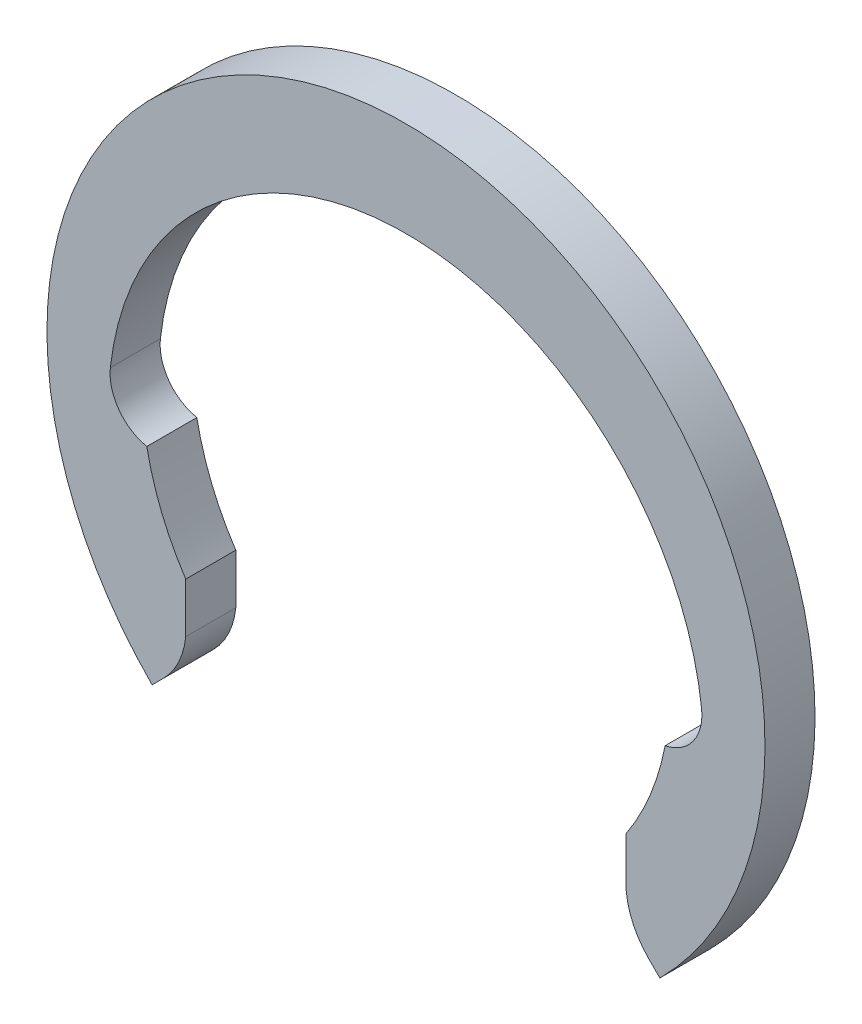
ISO-10303-21;
HEADER;
FILE_DESCRIPTION(('STEP AP214'),'2;1');
FILE_NAME('part.step','',(''),(''),'','','');
FILE_SCHEMA(('AUTOMOTIVE_DESIGN { 1 0 10303 214 1 1 1 1 }'));
ENDSEC;
DATA;
#1=APPLICATION_CONTEXT('core data for automotive mechanical design processes');
#2=APPLICATION_PROTOCOL_DEFINITION('international standard','automotive_design',2000,#1);
#3=PRODUCT_CONTEXT('',#1,'mechanical');
#4=PRODUCT('Part','Part','',(#3));
#5=PRODUCT_RELATED_PRODUCT_CATEGORY('part','',(#4));
#6=PRODUCT_DEFINITION_FORMATION('','',#4);
#7=PRODUCT_DEFINITION_CONTEXT('part definition',#1,'design');
#8=PRODUCT_DEFINITION('design','',#6,#7);
#9=PRODUCT_DEFINITION_SHAPE('','',#8);
#10=(LENGTH_UNIT() NAMED_UNIT(*) SI_UNIT(.MILLI.,.METRE.));
#11=(NAMED_UNIT(*) PLANE_ANGLE_UNIT() SI_UNIT($,.RADIAN.));
#12=(NAMED_UNIT(*) SI_UNIT($,.STERADIAN.) SOLID_ANGLE_UNIT());
#13=UNCERTAINTY_MEASURE_WITH_UNIT(LENGTH_MEASURE(1.E-05),#10,'distance_accuracy_value','');
#14=(GEOMETRIC_REPRESENTATION_CONTEXT(3) GLOBAL_UNCERTAINTY_ASSIGNED_CONTEXT((#13)) GLOBAL_UNIT_ASSIGNED_CONTEXT((#10,
#11,#12)) REPRESENTATION_CONTEXT('',''));
#15=CARTESIAN_POINT('',(0.,0.,0.));
#16=DIRECTION('',(0.,0.,1.));
#17=DIRECTION('',(1.,0.,0.));
#18=AXIS2_PLACEMENT_3D('',#15,#16,#17);
#19=CARTESIAN_POINT('',(-4.9996018580212,-0.103257531389518,1.));
#20=DIRECTION('',(0.,0.,-1.));
#21=DIRECTION('',(-1.,0.,0.));
#22=AXIS2_PLACEMENT_3D('',#19,#20,#21);
#23=CYLINDRICAL_SURFACE('',#22,0.914579144749987);
#24=CARTESIAN_POINT('',(-4.9996018580212,-0.103257531389518,0.));
#25=DIRECTION('',(0.,0.,-1.));
#26=DIRECTION('',(1.,0.,0.));
#27=AXIS2_PLACEMENT_3D('',#24,#25,#26);
#28=CIRCLE('',#27,0.914579144749987);
#29=CARTESIAN_POINT('',(-5.17934600118587,-0.999999999999997,0.));
#30=VERTEX_POINT('',#29);
#31=CARTESIAN_POINT('',(-5.90833333333334,0.,0.));
#32=VERTEX_POINT('',#31);
#33=EDGE_CURVE('E154',#30,#32,#28,.T.);
#34=ORIENTED_EDGE('',*,*,#33,.T.);
#35=DIRECTION('',(0.,0.,-1.));
#36=VECTOR('',#35,1.);
#37=CARTESIAN_POINT('',(-5.90833333333334,0.,1.));
#38=LINE('',#37,#36);
#39=CARTESIAN_POINT('',(-5.90833333333334,0.,1.));
#40=VERTEX_POINT('',#39);
#41=EDGE_CURVE('E11',#40,#32,#38,.T.);
#42=ORIENTED_EDGE('',*,*,#41,.F.);
#43=CARTESIAN_POINT('',(-4.9996018580212,-0.103257531389518,1.));
#44=DIRECTION('',(0.,0.,-1.));
#45=DIRECTION('',(1.,0.,0.));
#46=AXIS2_PLACEMENT_3D('',#43,#44,#45);
#47=CIRCLE('',#46,0.914579144749987);
#48=CARTESIAN_POINT('',(-5.17934600118587,-0.999999999999997,1.));
#49=VERTEX_POINT('',#48);
#50=EDGE_CURVE('E177',#49,#40,#47,.T.);
#51=ORIENTED_EDGE('',*,*,#50,.F.);
#52=DIRECTION('',(0.,0.,-1.));
#53=VECTOR('',#52,1.);
#54=CARTESIAN_POINT('',(-5.17934600118587,-0.999999999999997,1.));
#55=LINE('',#54,#53);
#56=EDGE_CURVE('E150',#49,#30,#55,.T.);
#57=ORIENTED_EDGE('',*,*,#56,.T.);
#58=EDGE_LOOP('',(#34,#42,#51,#57));
#59=FACE_BOUND('',#58,.T.);
#60=ADVANCED_FACE('F34',(#59),#23,.F.);
#61=CARTESIAN_POINT('',(0.,-0.671353343865192,1.));
#62=DIRECTION('',(0.,0.,-1.));
#63=DIRECTION('',(-1.,0.,0.));
#64=AXIS2_PLACEMENT_3D('',#61,#62,#63);
#65=CYLINDRICAL_SURFACE('',#64,5.94635334386519);
#66=CARTESIAN_POINT('',(0.,-0.671353343865192,0.));
#67=DIRECTION('',(0.,0.,-1.));
#68=DIRECTION('',(1.,0.,0.));
#69=AXIS2_PLACEMENT_3D('',#66,#67,#68);
#70=CIRCLE('',#69,5.94635334386519);
#71=CARTESIAN_POINT('',(5.90833333333333,0.,0.));
#72=VERTEX_POINT('',#71);
#73=EDGE_CURVE('E157',#32,#72,#70,.T.);
#74=ORIENTED_EDGE('',*,*,#73,.T.);
#75=DIRECTION('',(0.,0.,-1.));
#76=VECTOR('',#75,1.);
#77=CARTESIAN_POINT('',(5.90833333333333,0.,1.));
#78=LINE('',#77,#76);
#79=CARTESIAN_POINT('',(5.90833333333333,0.,1.));
#80=VERTEX_POINT('',#79);
#81=EDGE_CURVE('E42',#80,#72,#78,.T.);
#82=ORIENTED_EDGE('',*,*,#81,.F.);
#83=CARTESIAN_POINT('',(0.,-0.671353343865192,1.));
#84=DIRECTION('',(0.,0.,-1.));
#85=DIRECTION('',(1.,0.,0.));
#86=AXIS2_PLACEMENT_3D('',#83,#84,#85);
#87=CIRCLE('',#86,5.94635334386519);
#88=EDGE_CURVE('E104',#40,#80,#87,.T.);
#89=ORIENTED_EDGE('',*,*,#88,.F.);
#90=ORIENTED_EDGE('',*,*,#41,.T.);
#91=EDGE_LOOP('',(#74,#82,#89,#90));
#92=FACE_BOUND('',#91,.T.);
#93=ADVANCED_FACE('F254',(#92),#65,.F.);
#94=CARTESIAN_POINT('',(4.99960185802121,-0.103257531389516,1.));
#95=DIRECTION('',(0.,0.,-1.));
#96=DIRECTION('',(-1.,0.,0.));
#97=AXIS2_PLACEMENT_3D('',#94,#95,#96);
#98=CYLINDRICAL_SURFACE('',#97,0.914579144749987);
#99=CARTESIAN_POINT('',(4.99960185802121,-0.103257531389516,0.));
#100=DIRECTION('',(0.,0.,-1.));
#101=DIRECTION('',(-1.,0.,0.));
#102=AXIS2_PLACEMENT_3D('',#99,#100,#101);
#103=CIRCLE('',#102,0.914579144749987);
#104=CARTESIAN_POINT('',(5.17934600118587,-0.999999999999998,0.));
#105=VERTEX_POINT('',#104);
#106=EDGE_CURVE('E159',#72,#105,#103,.T.);
#107=ORIENTED_EDGE('',*,*,#106,.T.);
#108=DIRECTION('',(0.,0.,-1.));
#109=VECTOR('',#108,1.);
#110=CARTESIAN_POINT('',(5.17934600118587,-0.999999999999998,1.));
#111=LINE('',#110,#109);
#112=CARTESIAN_POINT('',(5.17934600118587,-0.999999999999998,1.));
#113=VERTEX_POINT('',#112);
#114=EDGE_CURVE('E196',#113,#105,#111,.T.);
#115=ORIENTED_EDGE('',*,*,#114,.F.);
#116=CARTESIAN_POINT('',(4.99960185802121,-0.103257531389516,1.));
#117=DIRECTION('',(0.,0.,-1.));
#118=DIRECTION('',(-1.,0.,0.));
#119=AXIS2_PLACEMENT_3D('',#116,#117,#118);
#120=CIRCLE('',#119,0.914579144749987);
#121=EDGE_CURVE('E204',#80,#113,#120,.T.);
#122=ORIENTED_EDGE('',*,*,#121,.F.);
#123=ORIENTED_EDGE('',*,*,#81,.T.);
#124=EDGE_LOOP('',(#107,#115,#122,#123));
#125=FACE_BOUND('',#124,.T.);
#126=ADVANCED_FACE('F202',(#125),#98,.F.);
#127=CARTESIAN_POINT('',(0.,0.,1.));
#128=DIRECTION('',(0.,0.,-1.));
#129=DIRECTION('',(-1.,0.,0.));
#130=AXIS2_PLACEMENT_3D('',#127,#128,#129);
#131=CYLINDRICAL_SURFACE('',#130,5.275);
#132=CARTESIAN_POINT('',(0.,0.,0.));
#133=DIRECTION('',(0.,0.,-1.));
#134=DIRECTION('',(-1.,0.,0.));
#135=AXIS2_PLACEMENT_3D('',#132,#133,#134);
#136=CIRCLE('',#135,5.275);
#137=CARTESIAN_POINT('',(4.40173971288627,-2.90694212188684,0.));
#138=VERTEX_POINT('',#137);
#139=EDGE_CURVE('E161',#105,#138,#136,.T.);
#140=ORIENTED_EDGE('',*,*,#139,.T.);
#141=DIRECTION('',(0.,0.,-1.));
#142=VECTOR('',#141,1.);
#143=CARTESIAN_POINT('',(4.40173971288627,-2.90694212188684,1.));
#144=LINE('',#143,#142);
#145=CARTESIAN_POINT('',(4.40173971288627,-2.90694212188684,1.));
#146=VERTEX_POINT('',#145);
#147=EDGE_CURVE('E193',#146,#138,#144,.T.);
#148=ORIENTED_EDGE('',*,*,#147,.F.);
#149=CARTESIAN_POINT('',(0.,0.,1.));
#150=DIRECTION('',(0.,0.,-1.));
#151=DIRECTION('',(-1.,0.,0.));
#152=AXIS2_PLACEMENT_3D('',#149,#150,#151);
#153=CIRCLE('',#152,5.275);
#154=EDGE_CURVE('E221',#113,#146,#153,.T.);
#155=ORIENTED_EDGE('',*,*,#154,.F.);
#156=ORIENTED_EDGE('',*,*,#114,.T.);
#157=EDGE_LOOP('',(#140,#148,#155,#156));
#158=FACE_BOUND('',#157,.T.);
#159=ADVANCED_FACE('F212',(#158),#131,.F.);
#160=CARTESIAN_POINT('',(4.40173971288627,-3.90347384921978,1.));
#161=DIRECTION('',(1.,0.,0.));
#162=DIRECTION('',(0.,1.,0.));
#163=AXIS2_PLACEMENT_3D('',#160,#161,#162);
#164=PLANE('',#163);
#165=DIRECTION('',(0.,-1.,0.));
#166=VECTOR('',#165,1.);
#167=CARTESIAN_POINT('',(4.40173971288627,-3.90347384921978,0.));
#168=LINE('',#167,#166);
#169=CARTESIAN_POINT('',(4.40173971288627,-3.90347384921978,0.));
#170=VERTEX_POINT('',#169);
#171=EDGE_CURVE('E164',#138,#170,#168,.T.);
#172=ORIENTED_EDGE('',*,*,#171,.T.);
#173=DIRECTION('',(0.,0.,-1.));
#174=VECTOR('',#173,1.);
#175=CARTESIAN_POINT('',(4.40173971288627,-3.90347384921978,1.));
#176=LINE('',#175,#174);
#177=CARTESIAN_POINT('',(4.40173971288627,-3.90347384921978,1.));
#178=VERTEX_POINT('',#177);
#179=EDGE_CURVE('E190',#178,#170,#176,.T.);
#180=ORIENTED_EDGE('',*,*,#179,.F.);
#181=DIRECTION('',(0.,-1.,0.));
#182=VECTOR('',#181,1.);
#183=CARTESIAN_POINT('',(4.40173971288627,-3.40520798555331,1.));
#184=LINE('',#183,#182);
#185=EDGE_CURVE('E218',#146,#178,#184,.T.);
#186=ORIENTED_EDGE('',*,*,#185,.F.);
#187=ORIENTED_EDGE('',*,*,#147,.T.);
#188=EDGE_LOOP('',(#172,#180,#186,#187));
#189=FACE_BOUND('',#188,.T.);
#190=ADVANCED_FACE('F216',(#189),#164,.F.);
#191=CARTESIAN_POINT('',(5.9490483497607,-3.75009966551478,1.));
#192=DIRECTION('',(0.,0.,-1.));
#193=DIRECTION('',(-1.,0.,0.));
#194=AXIS2_PLACEMENT_3D('',#191,#192,#193);
#195=CYLINDRICAL_SURFACE('',#194,1.55489152611151);
#196=CARTESIAN_POINT('',(5.9490483497607,-3.75009966551478,0.));
#197=DIRECTION('',(0.,0.,1.));
#198=DIRECTION('',(1.,0.,0.));
#199=AXIS2_PLACEMENT_3D('',#196,#197,#198);
#200=CIRCLE('',#199,1.55489152611151);
#201=CARTESIAN_POINT('',(4.84957400763775,-4.84957400763773,0.));
#202=VERTEX_POINT('',#201);
#203=EDGE_CURVE('E166',#170,#202,#200,.T.);
#204=ORIENTED_EDGE('',*,*,#203,.T.);
#205=DIRECTION('',(0.,0.,-1.));
#206=VECTOR('',#205,1.);
#207=CARTESIAN_POINT('',(4.84957400763775,-4.84957400763773,1.));
#208=LINE('',#207,#206);
#209=CARTESIAN_POINT('',(4.84957400763775,-4.84957400763773,1.));
#210=VERTEX_POINT('',#209);
#211=EDGE_CURVE('E187',#210,#202,#208,.T.);
#212=ORIENTED_EDGE('',*,*,#211,.F.);
#213=CARTESIAN_POINT('',(5.9490483497607,-3.75009966551478,1.));
#214=DIRECTION('',(0.,0.,1.));
#215=DIRECTION('',(1.,0.,0.));
#216=AXIS2_PLACEMENT_3D('',#213,#214,#215);
#217=CIRCLE('',#216,1.55489152611151);
#218=EDGE_CURVE('E220',#178,#210,#217,.T.);
#219=ORIENTED_EDGE('',*,*,#218,.F.);
#220=ORIENTED_EDGE('',*,*,#179,.T.);
#221=EDGE_LOOP('',(#204,#212,#219,#220));
#222=FACE_BOUND('',#221,.T.);
#223=ADVANCED_FACE('F267',(#222),#195,.T.);
#224=CARTESIAN_POINT('',(4.84957400763775,-4.84957400763773,1.));
#225=DIRECTION('',(0.707106781186547,0.707106781186547,0.));
#226=DIRECTION('',(-0.707106781186548,0.707106781186548,0.));
#227=AXIS2_PLACEMENT_3D('',#224,#225,#226);
#228=PLANE('',#227);
#229=DIRECTION('',(0.707106781186547,-0.707106781186547,0.));
#230=VECTOR('',#229,1.);
#231=CARTESIAN_POINT('',(4.84957400763775,-4.84957400763773,0.));
#232=LINE('',#231,#230);
#233=CARTESIAN_POINT('',(5.07349115501349,-5.07349115501347,0.));
#234=VERTEX_POINT('',#233);
#235=EDGE_CURVE('E168',#202,#234,#232,.T.);
#236=ORIENTED_EDGE('',*,*,#235,.T.);
#237=DIRECTION('',(0.,0.,-1.));
#238=VECTOR('',#237,1.);
#239=CARTESIAN_POINT('',(5.07349115501349,-5.07349115501347,1.));
#240=LINE('',#239,#238);
#241=CARTESIAN_POINT('',(5.07349115501349,-5.07349115501347,1.));
#242=VERTEX_POINT('',#241);
#243=EDGE_CURVE('E184',#242,#234,#240,.T.);
#244=ORIENTED_EDGE('',*,*,#243,.F.);
#245=DIRECTION('',(0.707106781186547,-0.707106781186547,0.));
#246=VECTOR('',#245,1.);
#247=CARTESIAN_POINT('',(4.84957400763775,-4.84957400763773,1.));
#248=LINE('',#247,#246);
#249=EDGE_CURVE('E223',#210,#242,#248,.T.);
#250=ORIENTED_EDGE('',*,*,#249,.F.);
#251=ORIENTED_EDGE('',*,*,#211,.T.);
#252=EDGE_LOOP('',(#236,#244,#250,#251));
#253=FACE_BOUND('',#252,.T.);
#254=ADVANCED_FACE('F270',(#253),#228,.F.);
#255=CARTESIAN_POINT('',(0.,0.,1.));
#256=DIRECTION('',(0.,0.,-1.));
#257=DIRECTION('',(-1.,0.,0.));
#258=AXIS2_PLACEMENT_3D('',#255,#256,#257);
#259=CYLINDRICAL_SURFACE('',#258,7.175);
#260=CARTESIAN_POINT('',(0.,0.,0.));
#261=DIRECTION('',(0.,0.,1.));
#262=DIRECTION('',(1.,0.,0.));
#263=AXIS2_PLACEMENT_3D('',#260,#261,#262);
#264=CIRCLE('',#263,7.175);
#265=CARTESIAN_POINT('',(-5.07349115501349,-5.07349115501347,0.));
#266=VERTEX_POINT('',#265);
#267=EDGE_CURVE('E170',#234,#266,#264,.T.);
#268=ORIENTED_EDGE('',*,*,#267,.T.);
#269=DIRECTION('',(0.,0.,-1.));
#270=VECTOR('',#269,1.);
#271=CARTESIAN_POINT('',(-5.07349115501349,-5.07349115501347,1.));
#272=LINE('',#271,#270);
#273=CARTESIAN_POINT('',(-5.07349115501349,-5.07349115501347,1.));
#274=VERTEX_POINT('',#273);
#275=EDGE_CURVE('E181',#274,#266,#272,.T.);
#276=ORIENTED_EDGE('',*,*,#275,.F.);
#277=CARTESIAN_POINT('',(0.,0.,1.));
#278=DIRECTION('',(0.,0.,1.));
#279=DIRECTION('',(1.,0.,0.));
#280=AXIS2_PLACEMENT_3D('',#277,#278,#279);
#281=CIRCLE('',#280,7.175);
#282=EDGE_CURVE('E229',#242,#274,#281,.T.);
#283=ORIENTED_EDGE('',*,*,#282,.F.);
#284=ORIENTED_EDGE('',*,*,#243,.T.);
#285=EDGE_LOOP('',(#268,#276,#283,#284));
#286=FACE_BOUND('',#285,.T.);
#287=ADVANCED_FACE('F235',(#286),#259,.T.);
#288=CARTESIAN_POINT('',(-4.84957400763775,-4.84957400763773,1.));
#289=DIRECTION('',(-0.707106781186547,0.707106781186547,0.));
#290=DIRECTION('',(-0.707106781186548,-0.707106781186548,0.));
#291=AXIS2_PLACEMENT_3D('',#288,#289,#290);
#292=PLANE('',#291);
#293=DIRECTION('',(0.707106781186547,0.707106781186547,0.));
#294=VECTOR('',#293,1.);
#295=CARTESIAN_POINT('',(-4.84957400763775,-4.84957400763773,0.));
#296=LINE('',#295,#294);
#297=CARTESIAN_POINT('',(-4.84957400763775,-4.84957400763773,0.));
#298=VERTEX_POINT('',#297);
#299=EDGE_CURVE('E172',#266,#298,#296,.T.);
#300=ORIENTED_EDGE('',*,*,#299,.T.);
#301=DIRECTION('',(0.,0.,-1.));
#302=VECTOR('',#301,1.);
#303=CARTESIAN_POINT('',(-4.84957400763775,-4.84957400763773,1.));
#304=LINE('',#303,#302);
#305=CARTESIAN_POINT('',(-4.84957400763775,-4.84957400763773,1.));
#306=VERTEX_POINT('',#305);
#307=EDGE_CURVE('E145',#306,#298,#304,.T.);
#308=ORIENTED_EDGE('',*,*,#307,.F.);
#309=DIRECTION('',(0.707106781186547,0.707106781186547,0.));
#310=VECTOR('',#309,1.);
#311=CARTESIAN_POINT('',(-4.84957400763775,-4.84957400763773,1.));
#312=LINE('',#311,#310);
#313=EDGE_CURVE('E135',#274,#306,#312,.T.);
#314=ORIENTED_EDGE('',*,*,#313,.F.);
#315=ORIENTED_EDGE('',*,*,#275,.T.);
#316=EDGE_LOOP('',(#300,#308,#314,#315));
#317=FACE_BOUND('',#316,.T.);
#318=ADVANCED_FACE('F239',(#317),#292,.F.);
#319=CARTESIAN_POINT('',(-5.9490483497607,-3.75009966551478,1.));
#320=DIRECTION('',(0.,0.,-1.));
#321=DIRECTION('',(-1.,0.,0.));
#322=AXIS2_PLACEMENT_3D('',#319,#320,#321);
#323=CYLINDRICAL_SURFACE('',#322,1.55489152611151);
#324=CARTESIAN_POINT('',(-5.9490483497607,-3.75009966551478,0.));
#325=DIRECTION('',(0.,0.,1.));
#326=DIRECTION('',(-1.,0.,0.));
#327=AXIS2_PLACEMENT_3D('',#324,#325,#326);
#328=CIRCLE('',#327,1.55489152611151);
#329=CARTESIAN_POINT('',(-4.40173971288626,-3.90347384921978,0.));
#330=VERTEX_POINT('',#329);
#331=EDGE_CURVE('E144',#298,#330,#328,.T.);
#332=ORIENTED_EDGE('',*,*,#331,.T.);
#333=DIRECTION('',(0.,0.,-1.));
#334=VECTOR('',#333,1.);
#335=CARTESIAN_POINT('',(-4.40173971288626,-3.90347384921978,1.));
#336=LINE('',#335,#334);
#337=CARTESIAN_POINT('',(-4.40173971288626,-3.90347384921978,1.));
#338=VERTEX_POINT('',#337);
#339=EDGE_CURVE('E141',#338,#330,#336,.T.);
#340=ORIENTED_EDGE('',*,*,#339,.F.);
#341=CARTESIAN_POINT('',(-5.9490483497607,-3.75009966551478,1.));
#342=DIRECTION('',(0.,0.,1.));
#343=DIRECTION('',(-1.,0.,0.));
#344=AXIS2_PLACEMENT_3D('',#341,#342,#343);
#345=CIRCLE('',#344,1.55489152611151);
#346=EDGE_CURVE('E129',#306,#338,#345,.T.);
#347=ORIENTED_EDGE('',*,*,#346,.F.);
#348=ORIENTED_EDGE('',*,*,#307,.T.);
#349=EDGE_LOOP('',(#332,#340,#347,#348));
#350=FACE_BOUND('',#349,.T.);
#351=ADVANCED_FACE('F142',(#350),#323,.T.);
#352=CARTESIAN_POINT('',(-4.40173971288626,-3.40520798555331,1.));
#353=DIRECTION('',(-1.,0.,0.));
#354=DIRECTION('',(0.,0.,1.));
#355=AXIS2_PLACEMENT_3D('',#352,#353,#354);
#356=PLANE('',#355);
#357=DIRECTION('',(0.,1.,0.));
#358=VECTOR('',#357,1.);
#359=CARTESIAN_POINT('',(-4.40173971288626,-3.40520798555331,0.));
#360=LINE('',#359,#358);
#361=CARTESIAN_POINT('',(-4.40173971288626,-2.90694212188684,0.));
#362=VERTEX_POINT('',#361);
#363=EDGE_CURVE('E90',#330,#362,#360,.T.);
#364=ORIENTED_EDGE('',*,*,#363,.T.);
#365=DIRECTION('',(0.,0.,-1.));
#366=VECTOR('',#365,1.);
#367=CARTESIAN_POINT('',(-4.40173971288626,-2.90694212188684,1.));
#368=LINE('',#367,#366);
#369=CARTESIAN_POINT('',(-4.40173971288626,-2.90694212188684,1.));
#370=VERTEX_POINT('',#369);
#371=EDGE_CURVE('E146',#370,#362,#368,.T.);
#372=ORIENTED_EDGE('',*,*,#371,.F.);
#373=DIRECTION('',(0.,1.,0.));
#374=VECTOR('',#373,1.);
#375=CARTESIAN_POINT('',(-4.40173971288626,-3.90347384921978,1.));
#376=LINE('',#375,#374);
#377=EDGE_CURVE('E133',#338,#370,#376,.T.);
#378=ORIENTED_EDGE('',*,*,#377,.F.);
#379=ORIENTED_EDGE('',*,*,#339,.T.);
#380=EDGE_LOOP('',(#364,#372,#378,#379));
#381=FACE_BOUND('',#380,.T.);
#382=ADVANCED_FACE('F148',(#381),#356,.F.);
#383=CARTESIAN_POINT('',(0.,0.,1.));
#384=DIRECTION('',(0.,0.,-1.));
#385=DIRECTION('',(-1.,0.,0.));
#386=AXIS2_PLACEMENT_3D('',#383,#384,#385);
#387=CYLINDRICAL_SURFACE('',#386,5.275);
#388=CARTESIAN_POINT('',(0.,0.,0.));
#389=DIRECTION('',(0.,0.,-1.));
#390=DIRECTION('',(1.,0.,0.));
#391=AXIS2_PLACEMENT_3D('',#388,#389,#390);
#392=CIRCLE('',#391,5.275);
#393=EDGE_CURVE('E96',#362,#30,#392,.T.);
#394=ORIENTED_EDGE('',*,*,#393,.T.);
#395=ORIENTED_EDGE('',*,*,#56,.F.);
#396=CARTESIAN_POINT('',(0.,0.,1.));
#397=DIRECTION('',(0.,0.,-1.));
#398=DIRECTION('',(1.,0.,0.));
#399=AXIS2_PLACEMENT_3D('',#396,#397,#398);
#400=CIRCLE('',#399,5.275);
#401=EDGE_CURVE('E50',#370,#49,#400,.T.);
#402=ORIENTED_EDGE('',*,*,#401,.F.);
#403=ORIENTED_EDGE('',*,*,#371,.T.);
#404=EDGE_LOOP('',(#394,#395,#402,#403));
#405=FACE_BOUND('',#404,.T.);
#406=ADVANCED_FACE('F243',(#405),#387,.F.);
#407=CARTESIAN_POINT('',(-4.9996018580212,-0.103257531389518,1.));
#408=DIRECTION('',(0.,0.,1.));
#409=DIRECTION('',(1.,0.,0.));
#410=AXIS2_PLACEMENT_3D('',#407,#408,#409);
#411=PLANE('',#410);
#412=ORIENTED_EDGE('',*,*,#50,.T.);
#413=ORIENTED_EDGE('',*,*,#88,.T.);
#414=ORIENTED_EDGE('',*,*,#121,.T.);
#415=ORIENTED_EDGE('',*,*,#154,.T.);
#416=ORIENTED_EDGE('',*,*,#185,.T.);
#417=ORIENTED_EDGE('',*,*,#218,.T.);
#418=ORIENTED_EDGE('',*,*,#249,.T.);
#419=ORIENTED_EDGE('',*,*,#282,.T.);
#420=ORIENTED_EDGE('',*,*,#313,.T.);
#421=ORIENTED_EDGE('',*,*,#346,.T.);
#422=ORIENTED_EDGE('',*,*,#377,.T.);
#423=ORIENTED_EDGE('',*,*,#401,.T.);
#424=EDGE_LOOP('',(#412,#413,#414,#415,#416,#417,#418,#419,#420,#421,#422,#423));
#425=FACE_BOUND('',#424,.T.);
#426=ADVANCED_FACE('F131',(#425),#411,.T.);
#427=CARTESIAN_POINT('',(-4.9996018580212,-0.103257531389518,0.));
#428=DIRECTION('',(0.,0.,1.));
#429=DIRECTION('',(1.,0.,0.));
#430=AXIS2_PLACEMENT_3D('',#427,#428,#429);
#431=PLANE('',#430);
#432=ORIENTED_EDGE('',*,*,#33,.F.);
#433=ORIENTED_EDGE('',*,*,#393,.F.);
#434=ORIENTED_EDGE('',*,*,#363,.F.);
#435=ORIENTED_EDGE('',*,*,#331,.F.);
#436=ORIENTED_EDGE('',*,*,#299,.F.);
#437=ORIENTED_EDGE('',*,*,#267,.F.);
#438=ORIENTED_EDGE('',*,*,#235,.F.);
#439=ORIENTED_EDGE('',*,*,#203,.F.);
#440=ORIENTED_EDGE('',*,*,#171,.F.);
#441=ORIENTED_EDGE('',*,*,#139,.F.);
#442=ORIENTED_EDGE('',*,*,#106,.F.);
#443=ORIENTED_EDGE('',*,*,#73,.F.);
#444=EDGE_LOOP('',(#432,#433,#434,#435,#436,#437,#438,#439,#440,#441,#442,#443));
#445=FACE_BOUND('',#444,.T.);
#446=ADVANCED_FACE('F208',(#445),#431,.F.);
#447=CLOSED_SHELL('',(#60,#93,#126,#159,#190,#223,#254,#287,#318,#351,#382,#406,#426,#446));
#448=MANIFOLD_SOLID_BREP('B2',#447);
#449=ADVANCED_BREP_SHAPE_REPRESENTATION('',(#18,#448),#14);
#450=SHAPE_DEFINITION_REPRESENTATION(#9,#449);
ENDSEC;
END-ISO-10303-21;
